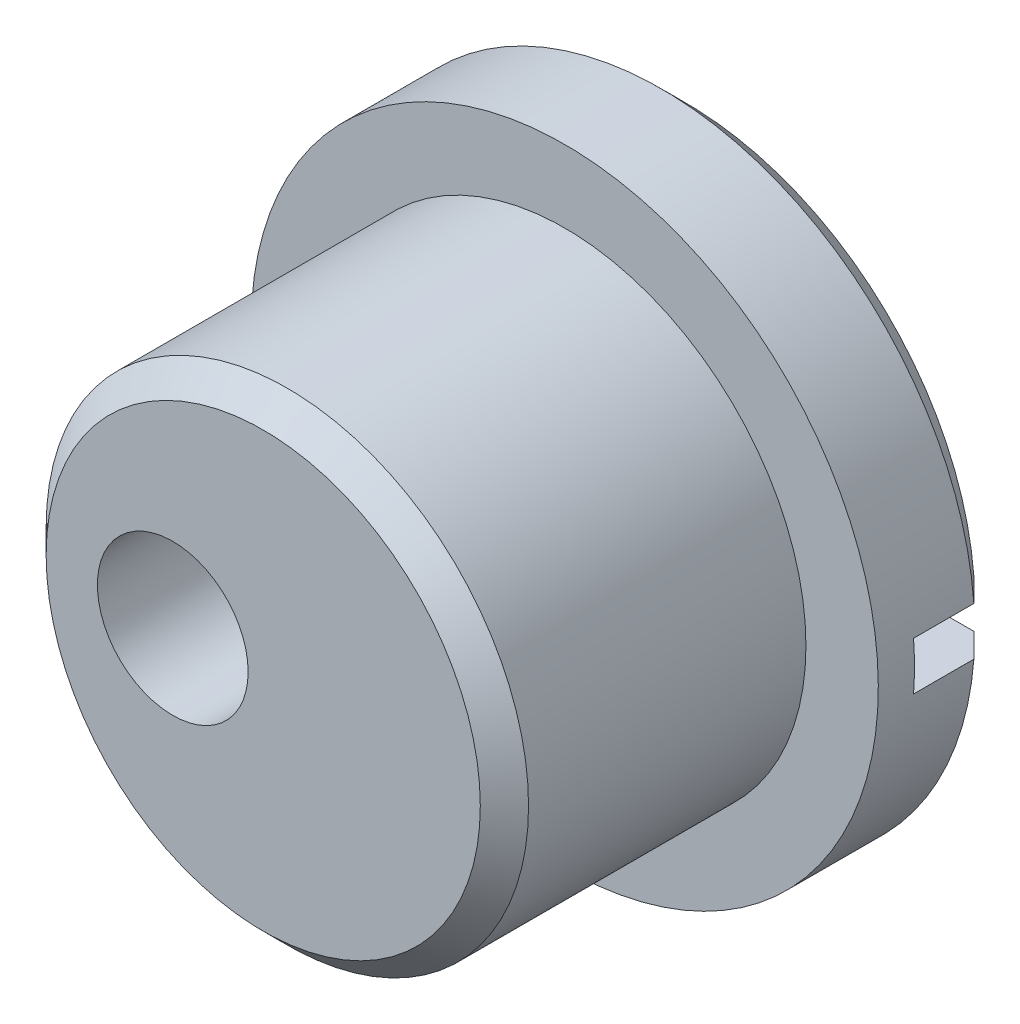
ISO-10303-21;
HEADER;
FILE_DESCRIPTION(('STEP AP214'),'2;1');
FILE_NAME('part.step','',(''),(''),'','','');
FILE_SCHEMA(('AUTOMOTIVE_DESIGN { 1 0 10303 214 1 1 1 1 }'));
ENDSEC;
DATA;
#1=APPLICATION_CONTEXT('core data for automotive mechanical design processes');
#2=APPLICATION_PROTOCOL_DEFINITION('international standard','automotive_design',2000,#1);
#3=PRODUCT_CONTEXT('',#1,'mechanical');
#4=PRODUCT('Part','Part','',(#3));
#5=PRODUCT_RELATED_PRODUCT_CATEGORY('part','',(#4));
#6=PRODUCT_DEFINITION_FORMATION('','',#4);
#7=PRODUCT_DEFINITION_CONTEXT('part definition',#1,'design');
#8=PRODUCT_DEFINITION('design','',#6,#7);
#9=PRODUCT_DEFINITION_SHAPE('','',#8);
#10=(LENGTH_UNIT() NAMED_UNIT(*) SI_UNIT(.MILLI.,.METRE.));
#11=(NAMED_UNIT(*) PLANE_ANGLE_UNIT() SI_UNIT($,.RADIAN.));
#12=(NAMED_UNIT(*) SI_UNIT($,.STERADIAN.) SOLID_ANGLE_UNIT());
#13=UNCERTAINTY_MEASURE_WITH_UNIT(LENGTH_MEASURE(1.E-05),#10,'distance_accuracy_value','');
#14=(GEOMETRIC_REPRESENTATION_CONTEXT(3) GLOBAL_UNCERTAINTY_ASSIGNED_CONTEXT((#13)) GLOBAL_UNIT_ASSIGNED_CONTEXT((#10,
#11,#12)) REPRESENTATION_CONTEXT('',''));
#15=CARTESIAN_POINT('',(0.,0.,0.));
#16=DIRECTION('',(0.,0.,1.));
#17=DIRECTION('',(1.,0.,0.));
#18=AXIS2_PLACEMENT_3D('',#15,#16,#17);
#19=CARTESIAN_POINT('',(0.,95.9979166304964,-2.));
#20=DIRECTION('',(0.,0.,1.));
#21=DIRECTION('',(1.,0.,0.));
#22=AXIS2_PLACEMENT_3D('',#19,#20,#21);
#23=CYLINDRICAL_SURFACE('',#22,1.25);
#24=CARTESIAN_POINT('',(0.,95.9979166304964,5.));
#25=DIRECTION('',(0.,0.,1.));
#26=DIRECTION('',(1.,0.,0.));
#27=AXIS2_PLACEMENT_3D('',#24,#25,#26);
#28=CIRCLE('',#27,1.25);
#29=CARTESIAN_POINT('',(1.25,95.9979166304964,5.));
#30=VERTEX_POINT('',#29);
#31=EDGE_CURVE('E162',#30,#30,#28,.T.);
#32=ORIENTED_EDGE('',*,*,#31,.T.);
#33=EDGE_LOOP('',(#32));
#34=FACE_BOUND('',#33,.T.);
#35=CARTESIAN_POINT('',(0.,95.9979166304964,0.5));
#36=DIRECTION('',(0.,0.,-1.));
#37=DIRECTION('',(-1.,0.,0.));
#38=AXIS2_PLACEMENT_3D('',#35,#36,#37);
#39=CIRCLE('',#38,1.25);
#40=CARTESIAN_POINT('',(-1.25,95.9979166304964,0.5));
#41=VERTEX_POINT('',#40);
#42=EDGE_CURVE('E122',#41,#41,#39,.F.);
#43=ORIENTED_EDGE('',*,*,#42,.F.);
#44=EDGE_LOOP('',(#43));
#45=FACE_BOUND('',#44,.T.);
#46=ADVANCED_FACE('F35',(#34,#45),#23,.F.);
#47=CARTESIAN_POINT('',(1.5,95.9979166304964,-2.));
#48=DIRECTION('',(0.,0.,-1.));
#49=DIRECTION('',(-1.,0.,0.));
#50=AXIS2_PLACEMENT_3D('',#47,#48,#49);
#51=PLANE('',#50);
#52=CARTESIAN_POINT('',(0.,95.9979166304964,-2.));
#53=DIRECTION('',(0.,0.,-1.));
#54=DIRECTION('',(-1.,0.,0.));
#55=AXIS2_PLACEMENT_3D('',#52,#53,#54);
#56=CIRCLE('',#55,2.00000000000001);
#57=CARTESIAN_POINT('',(-1.95959179422655,96.3979166304964,-2.));
#58=VERTEX_POINT('',#57);
#59=CARTESIAN_POINT('',(1.95959179422655,96.3979166304964,-2.));
#60=VERTEX_POINT('',#59);
#61=EDGE_CURVE('E114',#58,#60,#56,.T.);
#62=ORIENTED_EDGE('',*,*,#61,.F.);
#63=DIRECTION('',(1.,0.,0.));
#64=VECTOR('',#63,1.);
#65=CARTESIAN_POINT('',(11.5,96.3979166304964,-2.));
#66=LINE('',#65,#64);
#67=CARTESIAN_POINT('',(-3.28330429724055,96.3979166304964,-2.));
#68=VERTEX_POINT('',#67);
#69=EDGE_CURVE('E130',#68,#58,#66,.T.);
#70=ORIENTED_EDGE('',*,*,#69,.F.);
#71=CARTESIAN_POINT('',(1.5,95.9979166304964,-2.));
#72=DIRECTION('',(0.,0.,-1.));
#73=DIRECTION('',(-1.,0.,0.));
#74=AXIS2_PLACEMENT_3D('',#71,#72,#73);
#75=CIRCLE('',#74,4.8);
#76=CARTESIAN_POINT('',(6.28330429724056,96.3979166304964,-2.));
#77=VERTEX_POINT('',#76);
#78=EDGE_CURVE('E178',#68,#77,#75,.T.);
#79=ORIENTED_EDGE('',*,*,#78,.T.);
#80=EDGE_CURVE('E132',#60,#77,#66,.T.);
#81=ORIENTED_EDGE('',*,*,#80,.F.);
#82=EDGE_LOOP('',(#62,#70,#79,#81));
#83=FACE_BOUND('',#82,.T.);
#84=ADVANCED_FACE('F128',(#83),#51,.T.);
#85=CARTESIAN_POINT('',(1.5,95.9979166304964,-2.));
#86=DIRECTION('',(0.,0.,1.));
#87=DIRECTION('',(1.,0.,0.));
#88=AXIS2_PLACEMENT_3D('',#85,#86,#87);
#89=CONICAL_SURFACE('',#88,4.8,0.785398163397446);
#90=CARTESIAN_POINT('',(-9.93782147732291,96.3979166304964,4.64481367900369));
#91=CARTESIAN_POINT('',(-9.54148559957284,96.3979166304964,4.24872199144822));
#92=CARTESIAN_POINT('',(-9.14513906527661,96.3979166304964,3.85264096396759));
#93=CARTESIAN_POINT('',(-8.35240994574858,96.3979166304964,3.06051372904142));
#94=CARTESIAN_POINT('',(-7.95602736046053,96.3979166304964,2.66446752165216));
#95=CARTESIAN_POINT('',(-7.16319800564016,96.3979166304964,1.87241004499936));
#96=CARTESIAN_POINT('',(-6.76675123427683,96.3979166304964,1.4763987775686));
#97=CARTESIAN_POINT('',(-5.97378311183751,96.3979166304964,0.684452135411641));
#98=CARTESIAN_POINT('',(-5.57726176087774,96.3979166304964,0.288516760569094));
#99=CARTESIAN_POINT('',(-4.78644207962277,96.3979166304964,-0.500888879175847));
#100=CARTESIAN_POINT('',(-4.39214447497771,96.3979166304964,-0.894359871052881));
#101=CARTESIAN_POINT('',(-3.6033377557924,96.3979166304964,-1.68109344954176));
#102=CARTESIAN_POINT('',(-3.20882864030605,96.3979166304964,-2.07435603520547));
#103=CARTESIAN_POINT('',(-2.61673848783854,96.3979166304964,-2.66391294595665));
#104=CARTESIAN_POINT('',(-2.41932297000194,96.3979166304964,-2.86037349023558));
#105=CARTESIAN_POINT('',(-2.02431740428219,96.3979166304964,-3.25311984633127));
#106=CARTESIAN_POINT('',(-1.82672735609144,96.3979166304964,-3.44940565783885));
#107=CARTESIAN_POINT('',(-1.43125761448191,96.3979166304964,-3.84168192602904));
#108=CARTESIAN_POINT('',(-1.23337792348886,96.3979166304964,-4.0376723851576));
#109=CARTESIAN_POINT('',(-0.837099514534681,96.3979166304964,-4.42912769186224));
#110=CARTESIAN_POINT('',(-0.63870079857206,96.3979166304964,-4.62459254145633));
#111=CARTESIAN_POINT('',(-0.385111186626796,96.3979166304964,-4.87294798525578));
#112=CARTESIAN_POINT('',(-0.330457247820087,96.3979166304964,-4.92638638821439));
#113=CARTESIAN_POINT('',(-0.221028625292446,96.3979166304964,-5.03313947964481));
#114=CARTESIAN_POINT('',(-0.166253941305894,96.3979166304964,-5.08645416784393));
#115=CARTESIAN_POINT('',(-0.00161469288394384,96.3979166304964,-5.24625428359622));
#116=CARTESIAN_POINT('',(0.108475917769328,96.3979166304964,-5.35250825166419));
#117=CARTESIAN_POINT('',(0.293246087793646,96.3979166304964,-5.52886743220176));
#118=CARTESIAN_POINT('',(0.367601830326381,96.3979166304964,-5.59931188690549));
#119=CARTESIAN_POINT('',(0.517086364541082,96.3979166304964,-5.73915232774697));
#120=CARTESIAN_POINT('',(0.59221378520295,96.3979166304964,-5.80854976492837));
#121=CARTESIAN_POINT('',(0.719019086527403,96.3979166304964,-5.92281320540263));
#122=CARTESIAN_POINT('',(0.770229493320445,96.3979166304964,-5.96819729726158));
#123=CARTESIAN_POINT('',(0.874146188248804,96.3979166304964,-6.05772612594447));
#124=CARTESIAN_POINT('',(0.926858129266905,96.3979166304964,-6.10186443262686));
#125=CARTESIAN_POINT('',(1.0079481759971,96.3979166304964,-6.16608584321182));
#126=CARTESIAN_POINT('',(1.03545570817778,96.3979166304964,-6.1872612284211));
#127=CARTESIAN_POINT('',(1.0913175195741,96.3979166304964,-6.22845629010793));
#128=CARTESIAN_POINT('',(1.11967146214902,96.3979166304964,-6.24847641701085));
#129=CARTESIAN_POINT('',(1.17743265675262,96.3979166304964,-6.28659981797142));
#130=CARTESIAN_POINT('',(1.20683322559414,96.3979166304964,-6.30471306919458));
#131=CARTESIAN_POINT('',(1.26726750996494,96.3979166304964,-6.33791028534004));
#132=CARTESIAN_POINT('',(1.29829630534593,96.3979166304964,-6.35300278025696));
#133=CARTESIAN_POINT('',(1.35456023654893,96.3979166304964,-6.37495762666753));
#134=CARTESIAN_POINT('',(1.37934470569294,96.3979166304964,-6.38293109976875));
#135=CARTESIAN_POINT('',(1.42983684112294,96.3979166304964,-6.39462642864276));
#136=CARTESIAN_POINT('',(1.45553955869639,96.3979166304964,-6.39836831528818));
#137=CARTESIAN_POINT('',(1.50739885182006,96.3979166304964,-6.40077366513379));
#138=CARTESIAN_POINT('',(1.53355739861346,96.3979166304964,-6.39939776257648));
#139=CARTESIAN_POINT('',(1.58521273614315,96.3979166304964,-6.39183385906372));
#140=CARTESIAN_POINT('',(1.61070680399592,96.3979166304964,-6.38562854364755));
#141=CARTESIAN_POINT('',(1.65952626001173,96.3979166304964,-6.36996317460547));
#142=CARTESIAN_POINT('',(1.68289737994864,96.3979166304964,-6.36063810942665));
#143=CARTESIAN_POINT('',(1.72862107592632,96.3979166304964,-6.33972449898691));
#144=CARTESIAN_POINT('',(1.75097187369224,96.3979166304964,-6.32813217504152));
#145=CARTESIAN_POINT('',(1.79497081887565,96.3979166304964,-6.30333625470729));
#146=CARTESIAN_POINT('',(1.81661225072514,96.3979166304964,-6.29012096624276));
#147=CARTESIAN_POINT('',(1.85918658095019,96.3979166304964,-6.26264264464672));
#148=CARTESIAN_POINT('',(1.88012002789723,96.3979166304964,-6.2483804511843));
#149=CARTESIAN_POINT('',(1.94551092422103,96.3979166304964,-6.20211398248429));
#150=CARTESIAN_POINT('',(1.98901119624925,96.3979166304964,-6.16876728523317));
#151=CARTESIAN_POINT('',(2.07462211325842,96.3979166304964,-6.10032481439325));
#152=CARTESIAN_POINT('',(2.11673178775667,96.3979166304964,-6.06522786047737));
#153=CARTESIAN_POINT('',(2.20014846329283,96.3979166304964,-5.99393678375844));
#154=CARTESIAN_POINT('',(2.2414537952491,96.3979166304964,-5.95774071106296));
#155=CARTESIAN_POINT('',(2.32346871604645,96.3979166304964,-5.88470915787643));
#156=CARTESIAN_POINT('',(2.36417848232316,96.3979166304964,-5.84787387528084));
#157=CARTESIAN_POINT('',(2.48551659821126,96.3979166304964,-5.73691171707601));
#158=CARTESIAN_POINT('',(2.56556069108856,96.3979166304964,-5.66214717219299));
#159=CARTESIAN_POINT('',(2.72474579855974,96.3979166304964,-5.51184710528243));
#160=CARTESIAN_POINT('',(2.80388772359534,96.3979166304964,-5.43631253975786));
#161=CARTESIAN_POINT('',(2.96127048213346,96.3979166304964,-5.28512881048935));
#162=CARTESIAN_POINT('',(3.03951386239058,96.3979166304964,-5.20948229772281));
#163=CARTESIAN_POINT('',(3.19569019950067,96.3979166304964,-5.05786930767165));
#164=CARTESIAN_POINT('',(3.27362315473127,96.3979166304964,-4.98190282871908));
#165=CARTESIAN_POINT('',(3.50711534072938,96.3979166304964,-4.75368316082848));
#166=CARTESIAN_POINT('',(3.66236457013635,96.3979166304964,-4.60111295242314));
#167=CARTESIAN_POINT('',(3.97251290881682,96.3979166304964,-4.29547453479086));
#168=CARTESIAN_POINT('',(4.12741182264843,96.3979166304964,-4.14240612765567));
#169=CARTESIAN_POINT('',(4.43695359456896,96.3979166304964,-3.83601380120961));
#170=CARTESIAN_POINT('',(4.59159645526324,96.3979166304964,-3.68268988453081));
#171=CARTESIAN_POINT('',(5.05517918402773,96.3979166304964,-3.22259235303212));
#172=CARTESIAN_POINT('',(5.36388471219487,96.3979166304964,-2.91558273188738));
#173=CARTESIAN_POINT('',(5.98095815597707,96.3979166304964,-2.30131506943917));
#174=CARTESIAN_POINT('',(6.2893261144728,96.3979166304964,-1.99405707118132));
#175=CARTESIAN_POINT('',(7.12632177527481,96.3979166304964,-1.15963325988027));
#176=CARTESIAN_POINT('',(7.654791816152,96.3979166304964,-0.632309309466193));
#177=CARTESIAN_POINT('',(8.71155543671968,96.3979166304964,0.422575882225069));
#178=CARTESIAN_POINT('',(9.23984900455139,96.3979166304964,0.950137135376926));
#179=CARTESIAN_POINT('',(10.2964759314932,96.3979166304964,2.00552782805264));
#180=CARTESIAN_POINT('',(10.8248092572977,96.3979166304964,2.53335730092262));
#181=CARTESIAN_POINT('',(11.8813737317938,96.3979166304964,3.58905756116576));
#182=CARTESIAN_POINT('',(12.4096048846214,96.3979166304964,4.11692834439946));
#183=CARTESIAN_POINT('',(12.9378214773229,96.3979166304964,4.64481367900369));
#184=B_SPLINE_CURVE_WITH_KNOTS('',3,(#90,#91,#92,#93,#94,#95,#96,#97,#98,#99,#100,#101,#102,
#103,#104,#105,#106,#107,#108,#109,#110,#111,#112,#113,#114,#115,#116,#117,#118,#119,#120,#121,
#122,#123,#124,#125,#126,#127,#128,#129,#130,#131,#132,#133,#134,#135,#136,#137,#138,#139,#140,
#141,#142,#143,#144,#145,#146,#147,#148,#149,#150,#151,#152,#153,#154,#155,#156,#157,#158,#159,
#160,#161,#162,#163,#164,#165,#166,#167,#168,#169,#170,#171,#172,#173,#174,#175,#176,#177,#178,
#179,#180,#181,#182,#183),.UNSPECIFIED.,.F.,.F.,(4,2,2,2,2,2,2,2,2,2,2,2,2,2,2,2,2,2,2,2,2,2,2,
2,2,2,2,2,2,2,2,2,2,2,2,2,2,2,2,2,2,2,2,2,2,2,4),(0.,1.68099279815549,3.36198826543289,
5.04304587410824,6.72410088471943,8.39521134088157,10.0663293355204,10.9018690533152,
11.7374102466456,12.572944482002,13.4084755048405,13.6377882477862,13.8671014956848,
14.3261027614984,14.6333802236344,14.9401831963882,15.1454549757638,15.3516422492839,
15.4557662400771,15.5598493556314,15.6633575543514,15.7665692103246,15.8444107691109,
15.9218822898471,15.9999509452557,16.0783007898792,16.1536240248814,16.2290738824549,
16.3051032605505,16.3810723119832,16.5453983831167,16.7098368108666,16.8745863022704,
17.0392856673865,17.3678591404879,17.6960648830436,18.0225593626795,18.3490555464193,
19.0020617747211,19.6553704184687,20.3086723734048,21.6148058986595,22.9207478324655,
25.1604262292165,27.4002330768964,29.6406929497358,31.8810235848631),.UNSPECIFIED.);
#185=CARTESIAN_POINT('',(-3.68459255872629,96.3979166304964,-1.6));
#186=VERTEX_POINT('',#185);
#187=EDGE_CURVE('E137',#186,#68,#184,.T.);
#188=ORIENTED_EDGE('',*,*,#187,.F.);
#189=CARTESIAN_POINT('',(1.5,95.9979166304964,-1.6));
#190=DIRECTION('',(0.,0.,-1.));
#191=DIRECTION('',(-1.,0.,0.));
#192=AXIS2_PLACEMENT_3D('',#189,#190,#191);
#193=CIRCLE('',#192,5.2);
#194=CARTESIAN_POINT('',(6.68459255872629,96.3979166304964,-1.6));
#195=VERTEX_POINT('',#194);
#196=EDGE_CURVE('E180',#195,#186,#193,.F.);
#197=ORIENTED_EDGE('',*,*,#196,.F.);
#198=EDGE_CURVE('E192',#77,#195,#184,.T.);
#199=ORIENTED_EDGE('',*,*,#198,.F.);
#200=ORIENTED_EDGE('',*,*,#78,.F.);
#201=EDGE_LOOP('',(#188,#197,#199,#200));
#202=FACE_BOUND('',#201,.T.);
#203=ADVANCED_FACE('F234',(#202),#89,.T.);
#204=CARTESIAN_POINT('',(1.5,95.9979166304964,5.));
#205=DIRECTION('',(0.,0.,-1.));
#206=DIRECTION('',(-1.,0.,0.));
#207=AXIS2_PLACEMENT_3D('',#204,#205,#206);
#208=CYLINDRICAL_SURFACE('',#207,4.00000000000001);
#209=CARTESIAN_POINT('',(1.5,95.9979166304964,4.6));
#210=DIRECTION('',(0.,0.,1.));
#211=DIRECTION('',(1.,0.,0.));
#212=AXIS2_PLACEMENT_3D('',#209,#210,#211);
#213=CIRCLE('',#212,4.00000000000001);
#214=CARTESIAN_POINT('',(5.50000000000001,95.9979166304964,4.6));
#215=VERTEX_POINT('',#214);
#216=EDGE_CURVE('E174',#215,#215,#213,.F.);
#217=ORIENTED_EDGE('',*,*,#216,.T.);
#218=EDGE_LOOP('',(#217));
#219=FACE_BOUND('',#218,.T.);
#220=CARTESIAN_POINT('',(1.5,95.9979166304964,0.));
#221=DIRECTION('',(0.,0.,1.));
#222=DIRECTION('',(1.,0.,0.));
#223=AXIS2_PLACEMENT_3D('',#220,#221,#222);
#224=CIRCLE('',#223,4.00000000000001);
#225=CARTESIAN_POINT('',(5.50000000000001,95.9979166304964,0.));
#226=VERTEX_POINT('',#225);
#227=EDGE_CURVE('E168',#226,#226,#224,.T.);
#228=ORIENTED_EDGE('',*,*,#227,.T.);
#229=EDGE_LOOP('',(#228));
#230=FACE_BOUND('',#229,.T.);
#231=ADVANCED_FACE('F231',(#219,#230),#208,.T.);
#232=CARTESIAN_POINT('',(1.5,95.9979166304964,5.));
#233=DIRECTION('',(0.,0.,1.));
#234=DIRECTION('',(1.,0.,0.));
#235=AXIS2_PLACEMENT_3D('',#232,#233,#234);
#236=PLANE('',#235);
#237=CARTESIAN_POINT('',(1.5,95.9979166304964,5.));
#238=DIRECTION('',(0.,0.,1.));
#239=DIRECTION('',(1.,0.,0.));
#240=AXIS2_PLACEMENT_3D('',#237,#238,#239);
#241=CIRCLE('',#240,3.60000000000001);
#242=CARTESIAN_POINT('',(5.10000000000001,95.9979166304964,5.));
#243=VERTEX_POINT('',#242);
#244=EDGE_CURVE('E171',#243,#243,#241,.T.);
#245=ORIENTED_EDGE('',*,*,#244,.T.);
#246=EDGE_LOOP('',(#245));
#247=FACE_BOUND('',#246,.T.);
#248=ORIENTED_EDGE('',*,*,#31,.F.);
#249=EDGE_LOOP('',(#248));
#250=FACE_BOUND('',#249,.T.);
#251=ADVANCED_FACE('F227',(#247,#250),#236,.T.);
#252=CARTESIAN_POINT('',(1.5,95.9979166304964,-2.));
#253=DIRECTION('',(0.,0.,1.));
#254=DIRECTION('',(1.,0.,0.));
#255=AXIS2_PLACEMENT_3D('',#252,#253,#254);
#256=CYLINDRICAL_SURFACE('',#255,5.2);
#257=CARTESIAN_POINT('',(1.5,95.9979166304964,-0.6));
#258=DIRECTION('',(0.,0.,-1.));
#259=DIRECTION('',(-1.,0.,0.));
#260=AXIS2_PLACEMENT_3D('',#257,#258,#259);
#261=CIRCLE('',#260,5.2);
#262=CARTESIAN_POINT('',(6.68459255872629,96.3979166304964,-0.6));
#263=VERTEX_POINT('',#262);
#264=CARTESIAN_POINT('',(6.68459255872629,95.5979166304964,-0.6));
#265=VERTEX_POINT('',#264);
#266=EDGE_CURVE('E161',#263,#265,#261,.T.);
#267=ORIENTED_EDGE('',*,*,#266,.F.);
#268=DIRECTION('',(0.,0.,1.));
#269=VECTOR('',#268,1.);
#270=CARTESIAN_POINT('',(6.68459255872629,96.3979166304964,-2.));
#271=LINE('',#270,#269);
#272=EDGE_CURVE('E153',#263,#195,#271,.F.);
#273=ORIENTED_EDGE('',*,*,#272,.T.);
#274=ORIENTED_EDGE('',*,*,#196,.T.);
#275=DIRECTION('',(0.,0.,1.));
#276=VECTOR('',#275,1.);
#277=CARTESIAN_POINT('',(-3.68459255872629,96.3979166304964,-2.));
#278=LINE('',#277,#276);
#279=CARTESIAN_POINT('',(-3.68459255872629,96.3979166304964,-0.6));
#280=VERTEX_POINT('',#279);
#281=EDGE_CURVE('E156',#186,#280,#278,.T.);
#282=ORIENTED_EDGE('',*,*,#281,.T.);
#283=CARTESIAN_POINT('',(-3.68459255872629,95.5979166304964,-0.6));
#284=VERTEX_POINT('',#283);
#285=EDGE_CURVE('E159',#284,#280,#261,.T.);
#286=ORIENTED_EDGE('',*,*,#285,.F.);
#287=DIRECTION('',(0.,0.,1.));
#288=VECTOR('',#287,1.);
#289=CARTESIAN_POINT('',(-3.68459255872629,95.5979166304964,-2.));
#290=LINE('',#289,#288);
#291=CARTESIAN_POINT('',(-3.68459255872628,95.5979166304964,-1.6));
#292=VERTEX_POINT('',#291);
#293=EDGE_CURVE('E146',#284,#292,#290,.F.);
#294=ORIENTED_EDGE('',*,*,#293,.T.);
#295=CARTESIAN_POINT('',(6.68459255872629,95.5979166304964,-1.6));
#296=VERTEX_POINT('',#295);
#297=EDGE_CURVE('E181',#292,#296,#193,.F.);
#298=ORIENTED_EDGE('',*,*,#297,.T.);
#299=DIRECTION('',(0.,0.,1.));
#300=VECTOR('',#299,1.);
#301=CARTESIAN_POINT('',(6.68459255872629,95.5979166304964,-2.));
#302=LINE('',#301,#300);
#303=EDGE_CURVE('E149',#296,#265,#302,.T.);
#304=ORIENTED_EDGE('',*,*,#303,.T.);
#305=EDGE_LOOP('',(#267,#273,#274,#282,#286,#294,#298,#304));
#306=FACE_BOUND('',#305,.T.);
#307=CARTESIAN_POINT('',(1.5,95.9979166304964,0.));
#308=DIRECTION('',(0.,0.,-1.));
#309=DIRECTION('',(-1.,0.,0.));
#310=AXIS2_PLACEMENT_3D('',#307,#308,#309);
#311=CIRCLE('',#310,5.2);
#312=CARTESIAN_POINT('',(-3.7,95.9979166304964,0.));
#313=VERTEX_POINT('',#312);
#314=EDGE_CURVE('E165',#313,#313,#311,.T.);
#315=ORIENTED_EDGE('',*,*,#314,.T.);
#316=EDGE_LOOP('',(#315));
#317=FACE_BOUND('',#316,.T.);
#318=ADVANCED_FACE('F219',(#306,#317),#256,.T.);
#319=CARTESIAN_POINT('',(1.95959179422655,95.5979166304964,-2.));
#320=VERTEX_POINT('',#319);
#321=CARTESIAN_POINT('',(-1.95959179422655,95.5979166304964,-2.));
#322=VERTEX_POINT('',#321);
#323=EDGE_CURVE('E133',#320,#322,#56,.T.);
#324=ORIENTED_EDGE('',*,*,#323,.F.);
#325=DIRECTION('',(-1.,0.,0.));
#326=VECTOR('',#325,1.);
#327=CARTESIAN_POINT('',(11.5,95.5979166304964,-2.));
#328=LINE('',#327,#326);
#329=CARTESIAN_POINT('',(6.28330429724056,95.5979166304964,-2.));
#330=VERTEX_POINT('',#329);
#331=EDGE_CURVE('E142',#330,#320,#328,.T.);
#332=ORIENTED_EDGE('',*,*,#331,.F.);
#333=CARTESIAN_POINT('',(-3.28330429724055,95.5979166304964,-2.));
#334=VERTEX_POINT('',#333);
#335=EDGE_CURVE('E177',#330,#334,#75,.T.);
#336=ORIENTED_EDGE('',*,*,#335,.T.);
#337=EDGE_CURVE('E58',#322,#334,#328,.T.);
#338=ORIENTED_EDGE('',*,*,#337,.F.);
#339=EDGE_LOOP('',(#324,#332,#336,#338));
#340=FACE_BOUND('',#339,.T.);
#341=ADVANCED_FACE('F215',(#340),#51,.T.);
#342=CARTESIAN_POINT('',(1.5,95.9979166304964,0.));
#343=DIRECTION('',(0.,0.,-1.));
#344=DIRECTION('',(-1.,0.,0.));
#345=AXIS2_PLACEMENT_3D('',#342,#343,#344);
#346=PLANE('',#345);
#347=ORIENTED_EDGE('',*,*,#227,.F.);
#348=EDGE_LOOP('',(#347));
#349=FACE_BOUND('',#348,.T.);
#350=ORIENTED_EDGE('',*,*,#314,.F.);
#351=EDGE_LOOP('',(#350));
#352=FACE_BOUND('',#351,.T.);
#353=ADVANCED_FACE('F218',(#349,#352),#346,.F.);
#354=CARTESIAN_POINT('',(1.5,95.9979166304964,5.));
#355=DIRECTION('',(0.,0.,-1.));
#356=DIRECTION('',(-1.,0.,0.));
#357=AXIS2_PLACEMENT_3D('',#354,#355,#356);
#358=CONICAL_SURFACE('',#357,3.60000000000001,0.785398163397445);
#359=ORIENTED_EDGE('',*,*,#216,.F.);
#360=EDGE_LOOP('',(#359));
#361=FACE_BOUND('',#360,.T.);
#362=ORIENTED_EDGE('',*,*,#244,.F.);
#363=EDGE_LOOP('',(#362));
#364=FACE_BOUND('',#363,.T.);
#365=ADVANCED_FACE('F223',(#361,#364),#358,.T.);
#366=CARTESIAN_POINT('',(12.9378214773229,95.5979166304964,4.64481367900369));
#367=CARTESIAN_POINT('',(12.5414855995728,95.5979166304964,4.24872199144822));
#368=CARTESIAN_POINT('',(12.1451390652766,95.5979166304964,3.85264096396759));
#369=CARTESIAN_POINT('',(11.3524099457486,95.5979166304964,3.06051372904142));
#370=CARTESIAN_POINT('',(10.9560273604605,95.5979166304964,2.66446752165216));
#371=CARTESIAN_POINT('',(10.1631980056402,95.5979166304964,1.87241004499937));
#372=CARTESIAN_POINT('',(9.76675123427684,95.5979166304964,1.47639877756861));
#373=CARTESIAN_POINT('',(8.97378311183753,95.5979166304964,0.684452135411654));
#374=CARTESIAN_POINT('',(8.57726176087776,95.5979166304964,0.288516760569108));
#375=CARTESIAN_POINT('',(7.78644207962279,95.5979166304964,-0.500888879175832));
#376=CARTESIAN_POINT('',(7.39214447497772,95.5979166304964,-0.894359871052867));
#377=CARTESIAN_POINT('',(6.60333775579241,95.5979166304964,-1.68109344954175));
#378=CARTESIAN_POINT('',(6.20882864030606,95.5979166304964,-2.07435603520546));
#379=CARTESIAN_POINT('',(5.61673848783855,95.5979166304964,-2.66391294595665));
#380=CARTESIAN_POINT('',(5.41932297000195,95.5979166304964,-2.86037349023557));
#381=CARTESIAN_POINT('',(5.0243174042822,95.5979166304964,-3.25311984633126));
#382=CARTESIAN_POINT('',(4.82672735609144,95.5979166304964,-3.44940565783885));
#383=CARTESIAN_POINT('',(4.43125761448191,95.5979166304964,-3.84168192602903));
#384=CARTESIAN_POINT('',(4.23337792348887,95.5979166304964,-4.0376723851576));
#385=CARTESIAN_POINT('',(3.83709951453468,95.5979166304964,-4.42912769186224));
#386=CARTESIAN_POINT('',(3.63870079857206,95.5979166304964,-4.62459254145633));
#387=CARTESIAN_POINT('',(3.3851111866268,95.5979166304964,-4.87294798525578));
#388=CARTESIAN_POINT('',(3.33045724782009,95.5979166304964,-4.92638638821439));
#389=CARTESIAN_POINT('',(3.22102862529245,95.5979166304964,-5.03313947964481));
#390=CARTESIAN_POINT('',(3.16625394130589,95.5979166304964,-5.08645416784393));
#391=CARTESIAN_POINT('',(3.00161469288394,95.5979166304964,-5.24625428359622));
#392=CARTESIAN_POINT('',(2.89152408223067,95.5979166304964,-5.35250825166419));
#393=CARTESIAN_POINT('',(2.70675391220635,95.5979166304964,-5.52886743220176));
#394=CARTESIAN_POINT('',(2.63239816967362,95.5979166304964,-5.59931188690549));
#395=CARTESIAN_POINT('',(2.48291363545892,95.5979166304964,-5.73915232774697));
#396=CARTESIAN_POINT('',(2.40778621479705,95.5979166304964,-5.80854976492837));
#397=CARTESIAN_POINT('',(2.2809809134726,95.5979166304964,-5.92281320540263));
#398=CARTESIAN_POINT('',(2.22977050667956,95.5979166304964,-5.96819729726158));
#399=CARTESIAN_POINT('',(2.1258538117512,95.5979166304964,-6.05772612594447));
#400=CARTESIAN_POINT('',(2.0731418707331,95.5979166304964,-6.10186443262686));
#401=CARTESIAN_POINT('',(1.9920518240029,95.5979166304964,-6.16608584321182));
#402=CARTESIAN_POINT('',(1.96454429182222,95.5979166304964,-6.1872612284211));
#403=CARTESIAN_POINT('',(1.9086824804259,95.5979166304964,-6.22845629010793));
#404=CARTESIAN_POINT('',(1.88032853785098,95.5979166304964,-6.24847641701085));
#405=CARTESIAN_POINT('',(1.82256734324739,95.5979166304964,-6.28659981797142));
#406=CARTESIAN_POINT('',(1.79316677440586,95.5979166304964,-6.30471306919458));
#407=CARTESIAN_POINT('',(1.73273249003506,95.5979166304964,-6.33791028534004));
#408=CARTESIAN_POINT('',(1.70170369465407,95.5979166304964,-6.35300278025696));
#409=CARTESIAN_POINT('',(1.64543976345107,95.5979166304964,-6.37495762666753));
#410=CARTESIAN_POINT('',(1.62065529430706,95.5979166304964,-6.38293109976875));
#411=CARTESIAN_POINT('',(1.57016315887706,95.5979166304964,-6.39462642864276));
#412=CARTESIAN_POINT('',(1.54446044130361,95.5979166304964,-6.39836831528818));
#413=CARTESIAN_POINT('',(1.49260114817994,95.5979166304964,-6.40077366513379));
#414=CARTESIAN_POINT('',(1.46644260138654,95.5979166304964,-6.39939776257648));
#415=CARTESIAN_POINT('',(1.41478726385685,95.5979166304964,-6.39183385906372));
#416=CARTESIAN_POINT('',(1.38929319600408,95.5979166304964,-6.38562854364755));
#417=CARTESIAN_POINT('',(1.34047373998827,95.5979166304964,-6.36996317460547));
#418=CARTESIAN_POINT('',(1.31710262005135,95.5979166304964,-6.36063810942665));
#419=CARTESIAN_POINT('',(1.27137892407367,95.5979166304964,-6.3397244989869));
#420=CARTESIAN_POINT('',(1.24902812630776,95.5979166304964,-6.32813217504153));
#421=CARTESIAN_POINT('',(1.20502918112435,95.5979166304964,-6.30333625470729));
#422=CARTESIAN_POINT('',(1.18338774927486,95.5979166304964,-6.29012096624276));
#423=CARTESIAN_POINT('',(1.14081341904981,95.5979166304964,-6.26264264464672));
#424=CARTESIAN_POINT('',(1.11987997210277,95.5979166304964,-6.24838045118429));
#425=CARTESIAN_POINT('',(1.05448907577897,95.5979166304964,-6.20211398248429));
#426=CARTESIAN_POINT('',(1.01098880375075,95.5979166304964,-6.16876728523317));
#427=CARTESIAN_POINT('',(0.925377886741576,95.5979166304964,-6.10032481439325));
#428=CARTESIAN_POINT('',(0.883268212243327,95.5979166304964,-6.06522786047737));
#429=CARTESIAN_POINT('',(0.799851536707173,95.5979166304964,-5.99393678375844));
#430=CARTESIAN_POINT('',(0.758546204750898,95.5979166304964,-5.95774071106296));
#431=CARTESIAN_POINT('',(0.676531283953549,95.5979166304964,-5.88470915787643));
#432=CARTESIAN_POINT('',(0.635821517676841,95.5979166304964,-5.84787387528084));
#433=CARTESIAN_POINT('',(0.514483401788739,95.5979166304964,-5.73691171707601));
#434=CARTESIAN_POINT('',(0.434439308911438,95.5979166304964,-5.66214717219298));
#435=CARTESIAN_POINT('',(0.275254201440255,95.5979166304964,-5.51184710528243));
#436=CARTESIAN_POINT('',(0.196112276404658,95.5979166304964,-5.43631253975786));
#437=CARTESIAN_POINT('',(0.038729517866541,95.5979166304964,-5.28512881048935));
#438=CARTESIAN_POINT('',(-0.0395138623905816,95.5979166304964,-5.2094822977228));
#439=CARTESIAN_POINT('',(-0.195690199500668,95.5979166304964,-5.05786930767164));
#440=CARTESIAN_POINT('',(-0.273623154731277,95.5979166304964,-4.98190282871907));
#441=CARTESIAN_POINT('',(-0.507115340729387,95.5979166304964,-4.75368316082847));
#442=CARTESIAN_POINT('',(-0.662364570136358,95.5979166304964,-4.60111295242314));
#443=CARTESIAN_POINT('',(-0.97251290881682,95.5979166304964,-4.29547453479086));
#444=CARTESIAN_POINT('',(-1.12741182264843,95.5979166304964,-4.14240612765566));
#445=CARTESIAN_POINT('',(-1.43695359456897,95.5979166304964,-3.8360138012096));
#446=CARTESIAN_POINT('',(-1.59159645526325,95.5979166304964,-3.6826898845308));
#447=CARTESIAN_POINT('',(-2.05517918402773,95.5979166304964,-3.22259235303211));
#448=CARTESIAN_POINT('',(-2.36388471219488,95.5979166304964,-2.91558273188737));
#449=CARTESIAN_POINT('',(-2.98095815597708,95.5979166304964,-2.30131506943916));
#450=CARTESIAN_POINT('',(-3.28932611447281,95.5979166304964,-1.9940570711813));
#451=CARTESIAN_POINT('',(-4.12632177527482,95.5979166304964,-1.15963325988026));
#452=CARTESIAN_POINT('',(-4.65479181615201,95.5979166304964,-0.632309309466182));
#453=CARTESIAN_POINT('',(-5.71155543671968,95.5979166304964,0.422575882225077));
#454=CARTESIAN_POINT('',(-6.2398490045514,95.5979166304964,0.950137135376932));
#455=CARTESIAN_POINT('',(-7.29647593149324,95.5979166304964,2.00552782805264));
#456=CARTESIAN_POINT('',(-7.82480925729768,95.5979166304964,2.53335730092262));
#457=CARTESIAN_POINT('',(-8.88137373179379,95.5979166304964,3.58905756116576));
#458=CARTESIAN_POINT('',(-9.40960488462142,95.5979166304964,4.11692834439945));
#459=CARTESIAN_POINT('',(-9.93782147732291,95.5979166304964,4.64481367900369));
#460=B_SPLINE_CURVE_WITH_KNOTS('',3,(#366,#367,#368,#369,#370,#371,#372,#373,#374,#375,#376,
#377,#378,#379,#380,#381,#382,#383,#384,#385,#386,#387,#388,#389,#390,#391,#392,#393,#394,#395,
#396,#397,#398,#399,#400,#401,#402,#403,#404,#405,#406,#407,#408,#409,#410,#411,#412,#413,#414,
#415,#416,#417,#418,#419,#420,#421,#422,#423,#424,#425,#426,#427,#428,#429,#430,#431,#432,#433,
#434,#435,#436,#437,#438,#439,#440,#441,#442,#443,#444,#445,#446,#447,#448,#449,#450,#451,#452,
#453,#454,#455,#456,#457,#458,#459),.UNSPECIFIED.,.F.,.F.,(4,2,2,2,2,2,2,2,2,2,2,2,2,2,2,2,2,2,
2,2,2,2,2,2,2,2,2,2,2,2,2,2,2,2,2,2,2,2,2,2,2,2,2,2,2,2,4),(0.,1.68099279815549,
3.36198826543289,5.04304587410823,6.72410088471941,8.39521134088156,10.0663293355203,
10.9018690533152,11.7374102466456,12.572944482002,13.4084755048405,13.6377882477862,
13.8671014956848,14.3261027614984,14.6333802236344,14.9401831963882,15.1454549757638,
15.3516422492839,15.4557662400771,15.5598493556314,15.6633575543514,15.7665692103246,
15.8444107691109,15.9218822898471,15.9999509452557,16.0783007898792,16.1536240248814,
16.2290738824549,16.3051032605505,16.3810723119832,16.5453983831167,16.7098368108666,
16.8745863022704,17.0392856673865,17.3678591404879,17.6960648830436,18.0225593626795,
18.3490555464193,19.0020617747211,19.6553704184687,20.3086723734048,21.6148058986595,
22.9207478324655,25.1604262292165,27.4002330768964,29.6406929497358,31.8810235848631),.UNSPECIFIED.);
#461=EDGE_CURVE('E191',#296,#330,#460,.T.);
#462=ORIENTED_EDGE('',*,*,#461,.F.);
#463=ORIENTED_EDGE('',*,*,#297,.F.);
#464=EDGE_CURVE('E184',#334,#292,#460,.T.);
#465=ORIENTED_EDGE('',*,*,#464,.F.);
#466=ORIENTED_EDGE('',*,*,#335,.F.);
#467=EDGE_LOOP('',(#462,#463,#465,#466));
#468=FACE_BOUND('',#467,.T.);
#469=ADVANCED_FACE('F199',(#468),#89,.T.);
#470=CARTESIAN_POINT('',(11.5,96.3979166304964,-0.6));
#471=DIRECTION('',(0.,1.,0.));
#472=DIRECTION('',(0.,0.,1.));
#473=AXIS2_PLACEMENT_3D('',#470,#471,#472);
#474=PLANE('',#473);
#475=ORIENTED_EDGE('',*,*,#69,.T.);
#476=DIRECTION('',(0.,0.,-1.));
#477=VECTOR('',#476,1.);
#478=CARTESIAN_POINT('',(-1.95959179422655,96.3979166304964,0.5));
#479=LINE('',#478,#477);
#480=CARTESIAN_POINT('',(-1.95959179422655,96.3979166304964,-0.6));
#481=VERTEX_POINT('',#480);
#482=EDGE_CURVE('E111',#58,#481,#479,.F.);
#483=ORIENTED_EDGE('',*,*,#482,.T.);
#484=DIRECTION('',(1.,0.,0.));
#485=VECTOR('',#484,1.);
#486=CARTESIAN_POINT('',(11.5,96.3979166304964,-0.6));
#487=LINE('',#486,#485);
#488=EDGE_CURVE('E150',#280,#481,#487,.T.);
#489=ORIENTED_EDGE('',*,*,#488,.F.);
#490=ORIENTED_EDGE('',*,*,#281,.F.);
#491=ORIENTED_EDGE('',*,*,#187,.T.);
#492=EDGE_LOOP('',(#475,#483,#489,#490,#491));
#493=FACE_BOUND('',#492,.T.);
#494=ADVANCED_FACE('F135',(#493),#474,.F.);
#495=CARTESIAN_POINT('',(11.5,95.5979166304964,-0.6));
#496=DIRECTION('',(0.,-1.,0.));
#497=DIRECTION('',(0.,0.,-1.));
#498=AXIS2_PLACEMENT_3D('',#495,#496,#497);
#499=PLANE('',#498);
#500=DIRECTION('',(-1.,0.,0.));
#501=VECTOR('',#500,1.);
#502=CARTESIAN_POINT('',(11.5,95.5979166304964,-0.6));
#503=LINE('',#502,#501);
#504=CARTESIAN_POINT('',(-1.95959179422655,95.5979166304964,-0.6));
#505=VERTEX_POINT('',#504);
#506=EDGE_CURVE('E138',#505,#284,#503,.T.);
#507=ORIENTED_EDGE('',*,*,#506,.F.);
#508=DIRECTION('',(0.,0.,-1.));
#509=VECTOR('',#508,1.);
#510=CARTESIAN_POINT('',(-1.95959179422655,95.5979166304964,0.5));
#511=LINE('',#510,#509);
#512=EDGE_CURVE('E123',#505,#322,#511,.T.);
#513=ORIENTED_EDGE('',*,*,#512,.T.);
#514=ORIENTED_EDGE('',*,*,#337,.T.);
#515=ORIENTED_EDGE('',*,*,#464,.T.);
#516=ORIENTED_EDGE('',*,*,#293,.F.);
#517=EDGE_LOOP('',(#507,#513,#514,#515,#516));
#518=FACE_BOUND('',#517,.T.);
#519=ADVANCED_FACE('F209',(#518),#499,.F.);
#520=CARTESIAN_POINT('',(0.,0.,-0.6));
#521=DIRECTION('',(0.,0.,-1.));
#522=DIRECTION('',(-1.,0.,0.));
#523=AXIS2_PLACEMENT_3D('',#520,#521,#522);
#524=PLANE('',#523);
#525=CARTESIAN_POINT('',(0.,95.9979166304964,-0.6));
#526=DIRECTION('',(0.,0.,-1.));
#527=DIRECTION('',(-1.,0.,0.));
#528=AXIS2_PLACEMENT_3D('',#525,#526,#527);
#529=CIRCLE('',#528,2.00000000000001);
#530=EDGE_CURVE('E117',#505,#481,#529,.T.);
#531=ORIENTED_EDGE('',*,*,#530,.F.);
#532=ORIENTED_EDGE('',*,*,#506,.T.);
#533=ORIENTED_EDGE('',*,*,#285,.T.);
#534=ORIENTED_EDGE('',*,*,#488,.T.);
#535=EDGE_LOOP('',(#531,#532,#533,#534));
#536=FACE_BOUND('',#535,.T.);
#537=ADVANCED_FACE('F275',(#536),#524,.T.);
#538=CARTESIAN_POINT('',(0.,95.9979166304964,-0.6));
#539=DIRECTION('',(0.,0.,-1.));
#540=DIRECTION('',(-1.,0.,0.));
#541=AXIS2_PLACEMENT_3D('',#538,#539,#540);
#542=CIRCLE('',#541,2.00000000000001);
#543=CARTESIAN_POINT('',(1.95959179422655,96.3979166304964,-0.6));
#544=VERTEX_POINT('',#543);
#545=CARTESIAN_POINT('',(1.95959179422655,95.5979166304964,-0.6));
#546=VERTEX_POINT('',#545);
#547=EDGE_CURVE('E50',#544,#546,#542,.T.);
#548=ORIENTED_EDGE('',*,*,#547,.F.);
#549=EDGE_CURVE('E276',#544,#263,#487,.T.);
#550=ORIENTED_EDGE('',*,*,#549,.T.);
#551=ORIENTED_EDGE('',*,*,#266,.T.);
#552=EDGE_CURVE('E140',#265,#546,#503,.T.);
#553=ORIENTED_EDGE('',*,*,#552,.T.);
#554=EDGE_LOOP('',(#548,#550,#551,#553));
#555=FACE_BOUND('',#554,.T.);
#556=ADVANCED_FACE('F284',(#555),#524,.T.);
#557=ORIENTED_EDGE('',*,*,#549,.F.);
#558=DIRECTION('',(0.,0.,-1.));
#559=VECTOR('',#558,1.);
#560=CARTESIAN_POINT('',(1.95959179422655,96.3979166304964,0.5));
#561=LINE('',#560,#559);
#562=EDGE_CURVE('E280',#544,#60,#561,.T.);
#563=ORIENTED_EDGE('',*,*,#562,.T.);
#564=ORIENTED_EDGE('',*,*,#80,.T.);
#565=ORIENTED_EDGE('',*,*,#198,.T.);
#566=ORIENTED_EDGE('',*,*,#272,.F.);
#567=EDGE_LOOP('',(#557,#563,#564,#565,#566));
#568=FACE_BOUND('',#567,.T.);
#569=ADVANCED_FACE('F207',(#568),#474,.F.);
#570=ORIENTED_EDGE('',*,*,#331,.T.);
#571=DIRECTION('',(0.,0.,-1.));
#572=VECTOR('',#571,1.);
#573=CARTESIAN_POINT('',(1.95959179422655,95.5979166304964,0.5));
#574=LINE('',#573,#572);
#575=EDGE_CURVE('E252',#320,#546,#574,.F.);
#576=ORIENTED_EDGE('',*,*,#575,.T.);
#577=ORIENTED_EDGE('',*,*,#552,.F.);
#578=ORIENTED_EDGE('',*,*,#303,.F.);
#579=ORIENTED_EDGE('',*,*,#461,.T.);
#580=EDGE_LOOP('',(#570,#576,#577,#578,#579));
#581=FACE_BOUND('',#580,.T.);
#582=ADVANCED_FACE('F202',(#581),#499,.F.);
#583=CARTESIAN_POINT('',(0.,95.9979166304964,0.5));
#584=DIRECTION('',(0.,0.,-1.));
#585=DIRECTION('',(-1.,0.,0.));
#586=AXIS2_PLACEMENT_3D('',#583,#584,#585);
#587=PLANE('',#586);
#588=CARTESIAN_POINT('',(0.,95.9979166304964,0.5));
#589=DIRECTION('',(0.,0.,-1.));
#590=DIRECTION('',(-1.,0.,0.));
#591=AXIS2_PLACEMENT_3D('',#588,#589,#590);
#592=CIRCLE('',#591,1.50000000000001);
#593=CARTESIAN_POINT('',(-1.50000000000001,95.9979166304964,0.5));
#594=VERTEX_POINT('',#593);
#595=EDGE_CURVE('E43',#594,#594,#592,.T.);
#596=ORIENTED_EDGE('',*,*,#595,.T.);
#597=EDGE_LOOP('',(#596));
#598=FACE_BOUND('',#597,.T.);
#599=ORIENTED_EDGE('',*,*,#42,.T.);
#600=EDGE_LOOP('',(#599));
#601=FACE_BOUND('',#600,.T.);
#602=ADVANCED_FACE('F206',(#598,#601),#587,.T.);
#603=CARTESIAN_POINT('',(0.,95.9979166304964,0.5));
#604=DIRECTION('',(0.,0.,-1.));
#605=DIRECTION('',(-1.,0.,0.));
#606=AXIS2_PLACEMENT_3D('',#603,#604,#605);
#607=CYLINDRICAL_SURFACE('',#606,2.00000000000001);
#608=CARTESIAN_POINT('',(0.,95.9979166304964,0.));
#609=DIRECTION('',(0.,0.,-1.));
#610=DIRECTION('',(-1.,0.,0.));
#611=AXIS2_PLACEMENT_3D('',#608,#609,#610);
#612=CIRCLE('',#611,2.00000000000001);
#613=CARTESIAN_POINT('',(-2.00000000000001,95.9979166304964,0.));
#614=VERTEX_POINT('',#613);
#615=EDGE_CURVE('E11',#614,#614,#612,.F.);
#616=ORIENTED_EDGE('',*,*,#615,.T.);
#617=EDGE_LOOP('',(#616));
#618=FACE_BOUND('',#617,.T.);
#619=ORIENTED_EDGE('',*,*,#61,.T.);
#620=ORIENTED_EDGE('',*,*,#562,.F.);
#621=ORIENTED_EDGE('',*,*,#547,.T.);
#622=ORIENTED_EDGE('',*,*,#575,.F.);
#623=ORIENTED_EDGE('',*,*,#323,.T.);
#624=ORIENTED_EDGE('',*,*,#512,.F.);
#625=ORIENTED_EDGE('',*,*,#530,.T.);
#626=ORIENTED_EDGE('',*,*,#482,.F.);
#627=EDGE_LOOP('',(#619,#620,#621,#622,#623,#624,#625,#626));
#628=FACE_BOUND('',#627,.T.);
#629=ADVANCED_FACE('F113',(#618,#628),#607,.F.);
#630=CARTESIAN_POINT('',(0.,95.9979166304964,0.));
#631=DIRECTION('',(0.,0.,-1.));
#632=DIRECTION('',(-1.,0.,0.));
#633=AXIS2_PLACEMENT_3D('',#630,#631,#632);
#634=TOROIDAL_SURFACE('',#633,1.50000000000001,0.5);
#635=ORIENTED_EDGE('',*,*,#615,.F.);
#636=EDGE_LOOP('',(#635));
#637=FACE_BOUND('',#636,.T.);
#638=ORIENTED_EDGE('',*,*,#595,.F.);
#639=EDGE_LOOP('',(#638));
#640=FACE_BOUND('',#639,.T.);
#641=ADVANCED_FACE('F37',(#637,#640),#634,.F.);
#642=CLOSED_SHELL('',(#46,#84,#203,#231,#251,#318,#341,#353,#365,#469,#494,#519,#537,#556,#569,
#582,#602,#629,#641));
#643=MANIFOLD_SOLID_BREP('B2',#642);
#644=ADVANCED_BREP_SHAPE_REPRESENTATION('',(#18,#643),#14);
#645=SHAPE_DEFINITION_REPRESENTATION(#9,#644);
ENDSEC;
END-ISO-10303-21;
